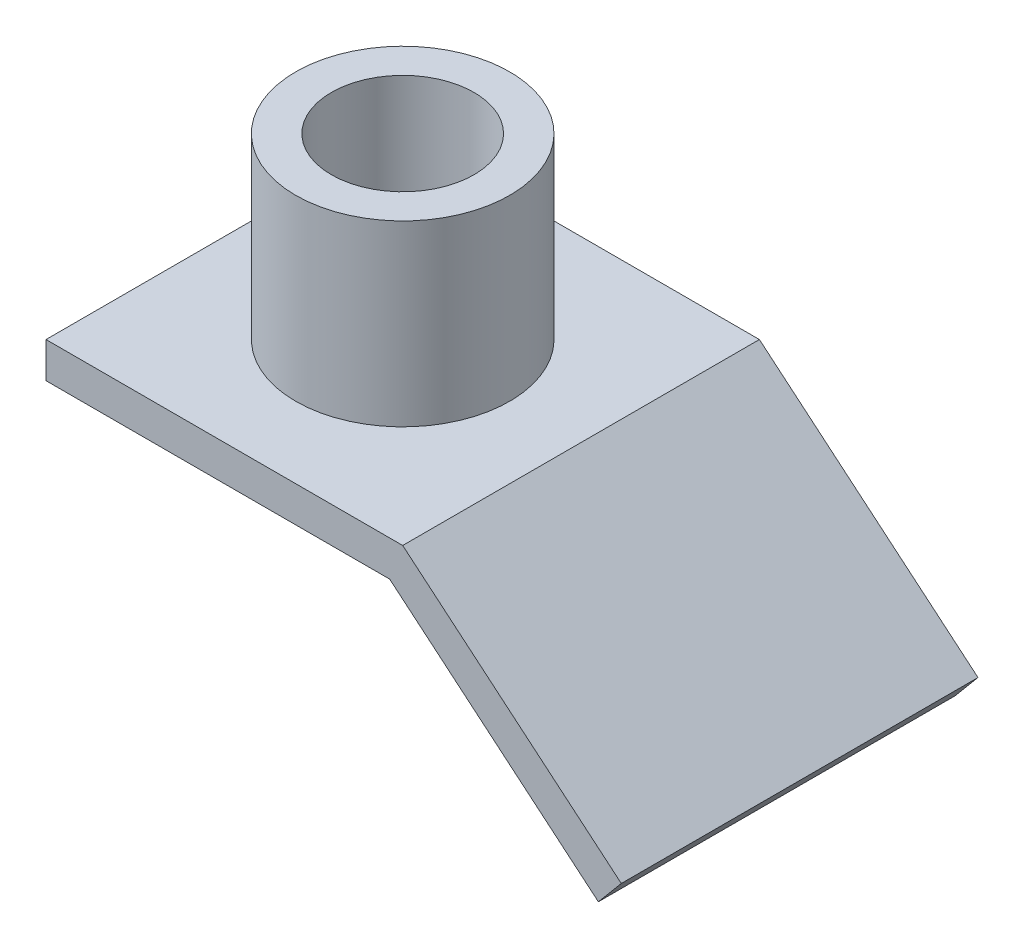
ISO-10303-21;
HEADER;
FILE_DESCRIPTION(('STEP AP214'),'2;1');
FILE_NAME('part.step','',(''),(''),'','','');
FILE_SCHEMA(('AUTOMOTIVE_DESIGN { 1 0 10303 214 1 1 1 1 }'));
ENDSEC;
DATA;
#1=APPLICATION_CONTEXT('core data for automotive mechanical design processes');
#2=APPLICATION_PROTOCOL_DEFINITION('international standard','automotive_design',2000,#1);
#3=PRODUCT_CONTEXT('',#1,'mechanical');
#4=PRODUCT('Part','Part','',(#3));
#5=PRODUCT_RELATED_PRODUCT_CATEGORY('part','',(#4));
#6=PRODUCT_DEFINITION_FORMATION('','',#4);
#7=PRODUCT_DEFINITION_CONTEXT('part definition',#1,'design');
#8=PRODUCT_DEFINITION('design','',#6,#7);
#9=PRODUCT_DEFINITION_SHAPE('','',#8);
#10=(LENGTH_UNIT() NAMED_UNIT(*) SI_UNIT(.MILLI.,.METRE.));
#11=(NAMED_UNIT(*) PLANE_ANGLE_UNIT() SI_UNIT($,.RADIAN.));
#12=(NAMED_UNIT(*) SI_UNIT($,.STERADIAN.) SOLID_ANGLE_UNIT());
#13=UNCERTAINTY_MEASURE_WITH_UNIT(LENGTH_MEASURE(1.E-05),#10,'distance_accuracy_value','');
#14=(GEOMETRIC_REPRESENTATION_CONTEXT(3) GLOBAL_UNCERTAINTY_ASSIGNED_CONTEXT((#13)) GLOBAL_UNIT_ASSIGNED_CONTEXT((#10,
#11,#12)) REPRESENTATION_CONTEXT('',''));
#15=CARTESIAN_POINT('',(0.,0.,0.));
#16=DIRECTION('',(0.,0.,1.));
#17=DIRECTION('',(1.,0.,0.));
#18=AXIS2_PLACEMENT_3D('',#15,#16,#17);
#19=CARTESIAN_POINT('',(43.5721239031346,-7.66044443118977,50.));
#20=DIRECTION('',(0.64278760968654,0.766044443118977,0.));
#21=DIRECTION('',(-0.766044443118977,0.64278760968654,0.));
#22=AXIS2_PLACEMENT_3D('',#19,#20,#21);
#23=PLANE('',#22);
#24=DIRECTION('',(0.766044443118977,-0.64278760968654,0.));
#25=VECTOR('',#24,1.);
#26=CARTESIAN_POINT('',(43.5721239031346,-7.66044443118977,-50.));
#27=LINE('',#26,#25);
#28=CARTESIAN_POINT('',(46.360297657338,-10.,-50.));
#29=VERTEX_POINT('',#28);
#30=CARTESIAN_POINT('',(104.855679352653,-59.083453206113,-50.));
#31=VERTEX_POINT('',#30);
#32=EDGE_CURVE('E115',#29,#31,#27,.T.);
#33=ORIENTED_EDGE('',*,*,#32,.T.);
#34=DIRECTION('',(0.,0.,-1.));
#35=VECTOR('',#34,1.);
#36=CARTESIAN_POINT('',(104.855679352653,-59.083453206113,50.));
#37=LINE('',#36,#35);
#38=CARTESIAN_POINT('',(104.855679352653,-59.083453206113,50.));
#39=VERTEX_POINT('',#38);
#40=EDGE_CURVE('E35',#39,#31,#37,.T.);
#41=ORIENTED_EDGE('',*,*,#40,.F.);
#42=DIRECTION('',(0.766044443118977,-0.64278760968654,0.));
#43=VECTOR('',#42,1.);
#44=CARTESIAN_POINT('',(43.5721239031346,-7.66044443118977,50.));
#45=LINE('',#44,#43);
#46=CARTESIAN_POINT('',(46.360297657338,-10.,50.));
#47=VERTEX_POINT('',#46);
#48=EDGE_CURVE('E80',#47,#39,#45,.T.);
#49=ORIENTED_EDGE('',*,*,#48,.F.);
#50=DIRECTION('',(0.,0.,-1.));
#51=VECTOR('',#50,1.);
#52=CARTESIAN_POINT('',(46.360297657338,-10.,50.));
#53=LINE('',#52,#51);
#54=EDGE_CURVE('E111',#47,#29,#53,.T.);
#55=ORIENTED_EDGE('',*,*,#54,.T.);
#56=EDGE_LOOP('',(#33,#41,#49,#55));
#57=FACE_BOUND('',#56,.T.);
#58=ADVANCED_FACE('F32',(#57),#23,.F.);
#59=CARTESIAN_POINT('',(111.283555449518,-51.4230087749232,50.));
#60=DIRECTION('',(0.766044443118977,-0.64278760968654,0.));
#61=DIRECTION('',(0.64278760968654,0.766044443118977,0.));
#62=AXIS2_PLACEMENT_3D('',#59,#60,#61);
#63=PLANE('',#62);
#64=DIRECTION('',(-0.64278760968654,-0.766044443118977,0.));
#65=VECTOR('',#64,1.);
#66=CARTESIAN_POINT('',(111.283555449518,-51.4230087749232,-50.));
#67=LINE('',#66,#65);
#68=CARTESIAN_POINT('',(111.283555449518,-51.4230087749232,-50.));
#69=VERTEX_POINT('',#68);
#70=EDGE_CURVE('E118',#69,#31,#67,.T.);
#71=ORIENTED_EDGE('',*,*,#70,.F.);
#72=DIRECTION('',(0.,0.,-1.));
#73=VECTOR('',#72,1.);
#74=CARTESIAN_POINT('',(111.283555449518,-51.4230087749232,50.));
#75=LINE('',#74,#73);
#76=CARTESIAN_POINT('',(111.283555449518,-51.4230087749232,50.));
#77=VERTEX_POINT('',#76);
#78=EDGE_CURVE('E131',#77,#69,#75,.T.);
#79=ORIENTED_EDGE('',*,*,#78,.F.);
#80=DIRECTION('',(-0.64278760968654,-0.766044443118977,0.));
#81=VECTOR('',#80,1.);
#82=CARTESIAN_POINT('',(111.283555449518,-51.4230087749232,50.));
#83=LINE('',#82,#81);
#84=EDGE_CURVE('E138',#77,#39,#83,.T.);
#85=ORIENTED_EDGE('',*,*,#84,.T.);
#86=ORIENTED_EDGE('',*,*,#40,.T.);
#87=EDGE_LOOP('',(#71,#79,#85,#86));
#88=FACE_BOUND('',#87,.T.);
#89=ADVANCED_FACE('F137',(#88),#63,.T.);
#90=CARTESIAN_POINT('',(50.,0.,50.));
#91=DIRECTION('',(0.64278760968654,0.766044443118977,0.));
#92=DIRECTION('',(-0.766044443118977,0.64278760968654,0.));
#93=AXIS2_PLACEMENT_3D('',#90,#91,#92);
#94=PLANE('',#93);
#95=DIRECTION('',(0.766044443118977,-0.64278760968654,0.));
#96=VECTOR('',#95,1.);
#97=CARTESIAN_POINT('',(50.,0.,-50.));
#98=LINE('',#97,#96);
#99=CARTESIAN_POINT('',(50.,0.,-50.));
#100=VERTEX_POINT('',#99);
#101=EDGE_CURVE('E122',#100,#69,#98,.T.);
#102=ORIENTED_EDGE('',*,*,#101,.F.);
#103=DIRECTION('',(0.,0.,-1.));
#104=VECTOR('',#103,1.);
#105=CARTESIAN_POINT('',(50.,0.,50.));
#106=LINE('',#105,#104);
#107=CARTESIAN_POINT('',(50.,0.,50.));
#108=VERTEX_POINT('',#107);
#109=EDGE_CURVE('E101',#108,#100,#106,.T.);
#110=ORIENTED_EDGE('',*,*,#109,.F.);
#111=DIRECTION('',(0.766044443118977,-0.64278760968654,0.));
#112=VECTOR('',#111,1.);
#113=CARTESIAN_POINT('',(50.,0.,50.));
#114=LINE('',#113,#112);
#115=EDGE_CURVE('E107',#108,#77,#114,.T.);
#116=ORIENTED_EDGE('',*,*,#115,.T.);
#117=ORIENTED_EDGE('',*,*,#78,.T.);
#118=EDGE_LOOP('',(#102,#110,#116,#117));
#119=FACE_BOUND('',#118,.T.);
#120=ADVANCED_FACE('F143',(#119),#94,.T.);
#121=CARTESIAN_POINT('',(-50.,0.,50.));
#122=DIRECTION('',(0.,1.,0.));
#123=DIRECTION('',(0.,0.,1.));
#124=AXIS2_PLACEMENT_3D('',#121,#122,#123);
#125=PLANE('',#124);
#126=CARTESIAN_POINT('',(0.,0.,0.));
#127=DIRECTION('',(0.,1.,0.));
#128=DIRECTION('',(0.,0.,1.));
#129=AXIS2_PLACEMENT_3D('',#126,#127,#128);
#130=CIRCLE('',#129,30.);
#131=CARTESIAN_POINT('',(0.,0.,30.));
#132=VERTEX_POINT('',#131);
#133=EDGE_CURVE('E11',#132,#132,#130,.T.);
#134=ORIENTED_EDGE('',*,*,#133,.F.);
#135=EDGE_LOOP('',(#134));
#136=FACE_BOUND('',#135,.T.);
#137=DIRECTION('',(1.,0.,0.));
#138=VECTOR('',#137,1.);
#139=CARTESIAN_POINT('',(-50.,0.,-50.));
#140=LINE('',#139,#138);
#141=CARTESIAN_POINT('',(-50.,0.,-50.));
#142=VERTEX_POINT('',#141);
#143=EDGE_CURVE('E96',#142,#100,#140,.T.);
#144=ORIENTED_EDGE('',*,*,#143,.F.);
#145=DIRECTION('',(0.,0.,-1.));
#146=VECTOR('',#145,1.);
#147=CARTESIAN_POINT('',(-50.,0.,50.));
#148=LINE('',#147,#146);
#149=CARTESIAN_POINT('',(-50.,0.,50.));
#150=VERTEX_POINT('',#149);
#151=EDGE_CURVE('E91',#150,#142,#148,.T.);
#152=ORIENTED_EDGE('',*,*,#151,.F.);
#153=DIRECTION('',(1.,0.,0.));
#154=VECTOR('',#153,1.);
#155=CARTESIAN_POINT('',(-50.,0.,50.));
#156=LINE('',#155,#154);
#157=EDGE_CURVE('E94',#150,#108,#156,.T.);
#158=ORIENTED_EDGE('',*,*,#157,.T.);
#159=ORIENTED_EDGE('',*,*,#109,.T.);
#160=EDGE_LOOP('',(#144,#152,#158,#159));
#161=FACE_BOUND('',#160,.T.);
#162=ADVANCED_FACE('F93',(#136,#161),#125,.T.);
#163=CARTESIAN_POINT('',(-50.,-10.,50.));
#164=DIRECTION('',(-1.,0.,0.));
#165=DIRECTION('',(0.,0.,1.));
#166=AXIS2_PLACEMENT_3D('',#163,#164,#165);
#167=PLANE('',#166);
#168=DIRECTION('',(0.,1.,0.));
#169=VECTOR('',#168,1.);
#170=CARTESIAN_POINT('',(-50.,-10.,-50.));
#171=LINE('',#170,#169);
#172=CARTESIAN_POINT('',(-50.,-10.,-50.));
#173=VERTEX_POINT('',#172);
#174=EDGE_CURVE('E126',#173,#142,#171,.T.);
#175=ORIENTED_EDGE('',*,*,#174,.F.);
#176=DIRECTION('',(0.,0.,-1.));
#177=VECTOR('',#176,1.);
#178=CARTESIAN_POINT('',(-50.,-10.,50.));
#179=LINE('',#178,#177);
#180=CARTESIAN_POINT('',(-50.,-10.,50.));
#181=VERTEX_POINT('',#180);
#182=EDGE_CURVE('E71',#181,#173,#179,.T.);
#183=ORIENTED_EDGE('',*,*,#182,.F.);
#184=DIRECTION('',(0.,1.,0.));
#185=VECTOR('',#184,1.);
#186=CARTESIAN_POINT('',(-50.,-10.,50.));
#187=LINE('',#186,#185);
#188=EDGE_CURVE('E105',#181,#150,#187,.T.);
#189=ORIENTED_EDGE('',*,*,#188,.T.);
#190=ORIENTED_EDGE('',*,*,#151,.T.);
#191=EDGE_LOOP('',(#175,#183,#189,#190));
#192=FACE_BOUND('',#191,.T.);
#193=ADVANCED_FACE('F109',(#192),#167,.T.);
#194=CARTESIAN_POINT('',(-50.,-10.,50.));
#195=DIRECTION('',(0.,1.,0.));
#196=DIRECTION('',(0.,0.,1.));
#197=AXIS2_PLACEMENT_3D('',#194,#195,#196);
#198=PLANE('',#197);
#199=CARTESIAN_POINT('',(0.,-10.,0.));
#200=DIRECTION('',(0.,1.,0.));
#201=DIRECTION('',(0.,0.,1.));
#202=AXIS2_PLACEMENT_3D('',#199,#200,#201);
#203=CIRCLE('',#202,20.);
#204=CARTESIAN_POINT('',(0.,-10.,20.));
#205=VERTEX_POINT('',#204);
#206=EDGE_CURVE('E149',#205,#205,#203,.T.);
#207=ORIENTED_EDGE('',*,*,#206,.T.);
#208=EDGE_LOOP('',(#207));
#209=FACE_BOUND('',#208,.T.);
#210=DIRECTION('',(1.,0.,0.));
#211=VECTOR('',#210,1.);
#212=CARTESIAN_POINT('',(-50.,-10.,-50.));
#213=LINE('',#212,#211);
#214=EDGE_CURVE('E74',#173,#29,#213,.T.);
#215=ORIENTED_EDGE('',*,*,#214,.T.);
#216=ORIENTED_EDGE('',*,*,#54,.F.);
#217=DIRECTION('',(1.,0.,0.));
#218=VECTOR('',#217,1.);
#219=CARTESIAN_POINT('',(-50.,-10.,50.));
#220=LINE('',#219,#218);
#221=EDGE_CURVE('E49',#181,#47,#220,.T.);
#222=ORIENTED_EDGE('',*,*,#221,.F.);
#223=ORIENTED_EDGE('',*,*,#182,.T.);
#224=EDGE_LOOP('',(#215,#216,#222,#223));
#225=FACE_BOUND('',#224,.T.);
#226=ADVANCED_FACE('F177',(#209,#225),#198,.F.);
#227=CARTESIAN_POINT('',(0.,0.,50.));
#228=DIRECTION('',(0.,0.,-1.));
#229=DIRECTION('',(-1.,0.,0.));
#230=AXIS2_PLACEMENT_3D('',#227,#228,#229);
#231=PLANE('',#230);
#232=ORIENTED_EDGE('',*,*,#48,.T.);
#233=ORIENTED_EDGE('',*,*,#84,.F.);
#234=ORIENTED_EDGE('',*,*,#115,.F.);
#235=ORIENTED_EDGE('',*,*,#157,.F.);
#236=ORIENTED_EDGE('',*,*,#188,.F.);
#237=ORIENTED_EDGE('',*,*,#221,.T.);
#238=EDGE_LOOP('',(#232,#233,#234,#235,#236,#237));
#239=FACE_BOUND('',#238,.T.);
#240=ADVANCED_FACE('F104',(#239),#231,.F.);
#241=CARTESIAN_POINT('',(0.,0.,-50.));
#242=DIRECTION('',(0.,0.,-1.));
#243=DIRECTION('',(-1.,0.,0.));
#244=AXIS2_PLACEMENT_3D('',#241,#242,#243);
#245=PLANE('',#244);
#246=ORIENTED_EDGE('',*,*,#32,.F.);
#247=ORIENTED_EDGE('',*,*,#214,.F.);
#248=ORIENTED_EDGE('',*,*,#174,.T.);
#249=ORIENTED_EDGE('',*,*,#143,.T.);
#250=ORIENTED_EDGE('',*,*,#101,.T.);
#251=ORIENTED_EDGE('',*,*,#70,.T.);
#252=EDGE_LOOP('',(#246,#247,#248,#249,#250,#251));
#253=FACE_BOUND('',#252,.T.);
#254=ADVANCED_FACE('F142',(#253),#245,.T.);
#255=CARTESIAN_POINT('',(0.,50.,0.));
#256=DIRECTION('',(0.,-1.,0.));
#257=DIRECTION('',(0.,0.,-1.));
#258=AXIS2_PLACEMENT_3D('',#255,#256,#257);
#259=CYLINDRICAL_SURFACE('',#258,30.);
#260=CARTESIAN_POINT('',(0.,50.,0.));
#261=DIRECTION('',(0.,1.,0.));
#262=DIRECTION('',(0.,0.,1.));
#263=AXIS2_PLACEMENT_3D('',#260,#261,#262);
#264=CIRCLE('',#263,30.);
#265=CARTESIAN_POINT('',(0.,50.,30.));
#266=VERTEX_POINT('',#265);
#267=EDGE_CURVE('E119',#266,#266,#264,.T.);
#268=ORIENTED_EDGE('',*,*,#267,.F.);
#269=EDGE_LOOP('',(#268));
#270=FACE_BOUND('',#269,.T.);
#271=ORIENTED_EDGE('',*,*,#133,.T.);
#272=EDGE_LOOP('',(#271));
#273=FACE_BOUND('',#272,.T.);
#274=ADVANCED_FACE('F162',(#270,#273),#259,.T.);
#275=CARTESIAN_POINT('',(0.,50.,0.));
#276=DIRECTION('',(0.,1.,0.));
#277=DIRECTION('',(0.,0.,1.));
#278=AXIS2_PLACEMENT_3D('',#275,#276,#277);
#279=PLANE('',#278);
#280=CARTESIAN_POINT('',(0.,50.,0.));
#281=DIRECTION('',(0.,1.,0.));
#282=DIRECTION('',(0.,0.,1.));
#283=AXIS2_PLACEMENT_3D('',#280,#281,#282);
#284=CIRCLE('',#283,20.);
#285=CARTESIAN_POINT('',(0.,50.,20.));
#286=VERTEX_POINT('',#285);
#287=EDGE_CURVE('E152',#286,#286,#284,.T.);
#288=ORIENTED_EDGE('',*,*,#287,.F.);
#289=EDGE_LOOP('',(#288));
#290=FACE_BOUND('',#289,.T.);
#291=ORIENTED_EDGE('',*,*,#267,.T.);
#292=EDGE_LOOP('',(#291));
#293=FACE_BOUND('',#292,.T.);
#294=ADVANCED_FACE('F159',(#290,#293),#279,.T.);
#295=CARTESIAN_POINT('',(0.,-59.083453206113,0.));
#296=DIRECTION('',(0.,1.,0.));
#297=DIRECTION('',(0.,0.,1.));
#298=AXIS2_PLACEMENT_3D('',#295,#296,#297);
#299=CYLINDRICAL_SURFACE('',#298,20.);
#300=ORIENTED_EDGE('',*,*,#287,.T.);
#301=EDGE_LOOP('',(#300));
#302=FACE_BOUND('',#301,.T.);
#303=ORIENTED_EDGE('',*,*,#206,.F.);
#304=EDGE_LOOP('',(#303));
#305=FACE_BOUND('',#304,.T.);
#306=ADVANCED_FACE('F156',(#302,#305),#299,.F.);
#307=CLOSED_SHELL('',(#58,#89,#120,#162,#193,#226,#240,#254,#274,#294,#306));
#308=MANIFOLD_SOLID_BREP('B2',#307);
#309=ADVANCED_BREP_SHAPE_REPRESENTATION('',(#18,#308),#14);
#310=SHAPE_DEFINITION_REPRESENTATION(#9,#309);
ENDSEC;
END-ISO-10303-21;
